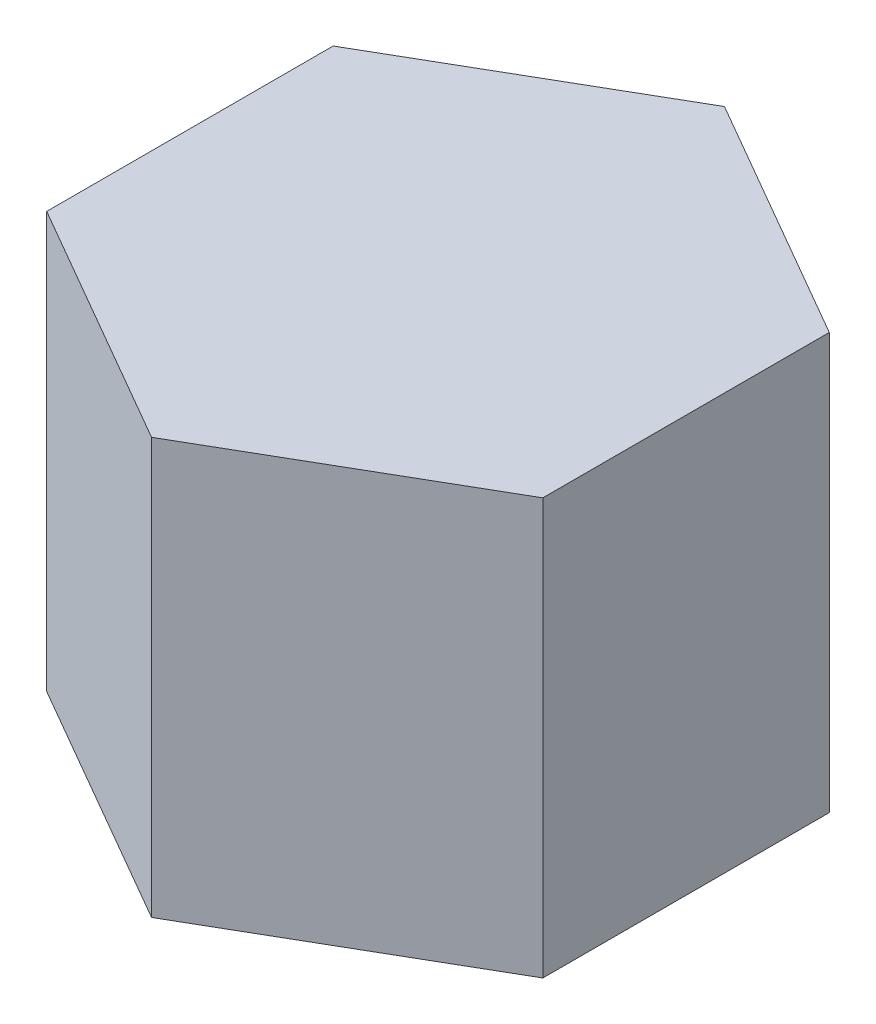
ISO-10303-21;
HEADER;
FILE_DESCRIPTION(('STEP AP214'),'2;1');
FILE_NAME('part.step','',(''),(''),'','','');
FILE_SCHEMA(('AUTOMOTIVE_DESIGN { 1 0 10303 214 1 1 1 1 }'));
ENDSEC;
DATA;
#1=APPLICATION_CONTEXT('core data for automotive mechanical design processes');
#2=APPLICATION_PROTOCOL_DEFINITION('international standard','automotive_design',2000,#1);
#3=PRODUCT_CONTEXT('',#1,'mechanical');
#4=PRODUCT('Part','Part','',(#3));
#5=PRODUCT_RELATED_PRODUCT_CATEGORY('part','',(#4));
#6=PRODUCT_DEFINITION_FORMATION('','',#4);
#7=PRODUCT_DEFINITION_CONTEXT('part definition',#1,'design');
#8=PRODUCT_DEFINITION('design','',#6,#7);
#9=PRODUCT_DEFINITION_SHAPE('','',#8);
#10=(LENGTH_UNIT() NAMED_UNIT(*) SI_UNIT(.MILLI.,.METRE.));
#11=(NAMED_UNIT(*) PLANE_ANGLE_UNIT() SI_UNIT($,.RADIAN.));
#12=(NAMED_UNIT(*) SI_UNIT($,.STERADIAN.) SOLID_ANGLE_UNIT());
#13=UNCERTAINTY_MEASURE_WITH_UNIT(LENGTH_MEASURE(1.E-05),#10,'distance_accuracy_value','');
#14=(GEOMETRIC_REPRESENTATION_CONTEXT(3) GLOBAL_UNCERTAINTY_ASSIGNED_CONTEXT((#13)) GLOBAL_UNIT_ASSIGNED_CONTEXT((#10,
#11,#12)) REPRESENTATION_CONTEXT('',''));
#15=CARTESIAN_POINT('',(0.,0.,0.));
#16=DIRECTION('',(0.,0.,1.));
#17=DIRECTION('',(1.,0.,0.));
#18=AXIS2_PLACEMENT_3D('',#15,#16,#17);
#19=CARTESIAN_POINT('',(211.142660308706,-148.537700895744,294.105047431848));
#20=DIRECTION('',(-0.499999999999909,0.,-0.866025403784491));
#21=DIRECTION('',(-0.866025403784491,0.,0.499999999999909));
#22=AXIS2_PLACEMENT_3D('',#19,#20,#21);
#23=PLANE('',#22);
#24=CARTESIAN_POINT('',(210.839551417381,-149.045793579175,294.280047431848));
#25=DIRECTION('',(0.866025403784491,0.,-0.499999999999909));
#26=VECTOR('',#25,1.);
#27=LINE('',#24,#26);
#28=CARTESIAN_POINT('',(210.839551417382,-149.045793579175,294.280047431848));
#29=VERTEX_POINT('',#28);
#30=CARTESIAN_POINT('',(211.142660308706,-149.045793579175,294.105047431848));
#31=VERTEX_POINT('',#30);
#32=EDGE_CURVE('E170',#29,#31,#27,.T.);
#33=ORIENTED_EDGE('',*,*,#32,.T.);
#34=CARTESIAN_POINT('',(211.142660308706,-148.537700895744,294.105047431848));
#35=DIRECTION('',(0.,-1.,0.));
#36=VECTOR('',#35,1.);
#37=LINE('',#34,#36);
#38=CARTESIAN_POINT('',(211.142660308706,-148.537700895744,294.105047431848));
#39=VERTEX_POINT('',#38);
#40=EDGE_CURVE('E35',#39,#31,#37,.T.);
#41=ORIENTED_EDGE('',*,*,#40,.F.);
#42=CARTESIAN_POINT('',(210.839551417381,-148.537700895744,294.280047431848));
#43=DIRECTION('',(0.866025403784491,0.,-0.499999999999909));
#44=VECTOR('',#43,1.);
#45=LINE('',#42,#44);
#46=CARTESIAN_POINT('',(210.839551417382,-148.537700895744,294.280047431848));
#47=VERTEX_POINT('',#46);
#48=EDGE_CURVE('E159',#47,#39,#45,.T.);
#49=ORIENTED_EDGE('',*,*,#48,.F.);
#50=CARTESIAN_POINT('',(210.839551417381,-148.537700895744,294.280047431848));
#51=DIRECTION('',(0.,-1.,0.));
#52=VECTOR('',#51,1.);
#53=LINE('',#50,#52);
#54=EDGE_CURVE('E10',#47,#29,#53,.T.);
#55=ORIENTED_EDGE('',*,*,#54,.T.);
#56=EDGE_LOOP('',(#33,#41,#49,#55));
#57=FACE_BOUND('',#56,.T.);
#58=ADVANCED_FACE('F16',(#57),#23,.F.);
#59=CARTESIAN_POINT('',(210.839551417382,-148.537700895744,294.280047431848));
#60=DIRECTION('',(0.500000000000096,0.,-0.866025403784383));
#61=DIRECTION('',(-0.866025403784383,0.,-0.500000000000096));
#62=AXIS2_PLACEMENT_3D('',#59,#60,#61);
#63=PLANE('',#62);
#64=CARTESIAN_POINT('',(210.536442526057,-149.045793579175,294.105047431848));
#65=DIRECTION('',(0.866025403784383,0.,0.500000000000096));
#66=VECTOR('',#65,1.);
#67=LINE('',#64,#66);
#68=CARTESIAN_POINT('',(210.536442526057,-149.045793579175,294.105047431848));
#69=VERTEX_POINT('',#68);
#70=EDGE_CURVE('E167',#69,#29,#67,.T.);
#71=ORIENTED_EDGE('',*,*,#70,.T.);
#72=ORIENTED_EDGE('',*,*,#54,.F.);
#73=CARTESIAN_POINT('',(210.536442526057,-148.537700895744,294.105047431848));
#74=DIRECTION('',(0.866025403784383,0.,0.500000000000096));
#75=VECTOR('',#74,1.);
#76=LINE('',#73,#75);
#77=CARTESIAN_POINT('',(210.536442526057,-148.537700895744,294.105047431848));
#78=VERTEX_POINT('',#77);
#79=EDGE_CURVE('E156',#78,#47,#76,.T.);
#80=ORIENTED_EDGE('',*,*,#79,.F.);
#81=CARTESIAN_POINT('',(210.536442526057,-148.537700895744,294.105047431848));
#82=DIRECTION('',(0.,-1.,0.));
#83=VECTOR('',#82,1.);
#84=LINE('',#81,#83);
#85=EDGE_CURVE('E27',#78,#69,#84,.T.);
#86=ORIENTED_EDGE('',*,*,#85,.T.);
#87=EDGE_LOOP('',(#71,#72,#80,#86));
#88=FACE_BOUND('',#87,.T.);
#89=ADVANCED_FACE('F189',(#88),#63,.F.);
#90=CARTESIAN_POINT('',(210.536442526057,-148.537700895744,290.831971220494));
#91=DIRECTION('',(1.,0.,0.));
#92=DIRECTION('',(0.,1.,0.));
#93=AXIS2_PLACEMENT_3D('',#90,#91,#92);
#94=PLANE('',#93);
#95=CARTESIAN_POINT('',(210.536442526057,-149.045793579175,293.755047431848));
#96=DIRECTION('',(0.,0.,1.));
#97=VECTOR('',#96,1.);
#98=LINE('',#95,#97);
#99=CARTESIAN_POINT('',(210.536442526057,-149.045793579175,293.755047431848));
#100=VERTEX_POINT('',#99);
#101=EDGE_CURVE('E163',#100,#69,#98,.T.);
#102=ORIENTED_EDGE('',*,*,#101,.T.);
#103=ORIENTED_EDGE('',*,*,#85,.F.);
#104=CARTESIAN_POINT('',(210.536442526057,-148.537700895744,293.755047431848));
#105=DIRECTION('',(0.,0.,1.));
#106=VECTOR('',#105,1.);
#107=LINE('',#104,#106);
#108=CARTESIAN_POINT('',(210.536442526057,-148.537700895744,293.755047431848));
#109=VERTEX_POINT('',#108);
#110=EDGE_CURVE('E106',#109,#78,#107,.T.);
#111=ORIENTED_EDGE('',*,*,#110,.F.);
#112=CARTESIAN_POINT('',(210.536442526057,-148.537700895744,293.755047431848));
#113=DIRECTION('',(0.,-1.,0.));
#114=VECTOR('',#113,1.);
#115=LINE('',#112,#114);
#116=EDGE_CURVE('E94',#109,#100,#115,.T.);
#117=ORIENTED_EDGE('',*,*,#116,.T.);
#118=EDGE_LOOP('',(#102,#103,#111,#117));
#119=FACE_BOUND('',#118,.T.);
#120=ADVANCED_FACE('F198',(#119),#94,.F.);
#121=CARTESIAN_POINT('',(210.536442526057,-148.537700895744,293.755047431848));
#122=DIRECTION('',(0.499999999999978,0.,0.866025403784452));
#123=DIRECTION('',(0.866025403784452,0.,-0.499999999999978));
#124=AXIS2_PLACEMENT_3D('',#121,#122,#123);
#125=PLANE('',#124);
#126=CARTESIAN_POINT('',(210.839551417382,-149.045793579175,293.580047431848));
#127=DIRECTION('',(-0.866025403784452,0.,0.499999999999978));
#128=VECTOR('',#127,1.);
#129=LINE('',#126,#128);
#130=CARTESIAN_POINT('',(210.839551417382,-149.045793579175,293.580047431848));
#131=VERTEX_POINT('',#130);
#132=EDGE_CURVE('E162',#131,#100,#129,.T.);
#133=ORIENTED_EDGE('',*,*,#132,.T.);
#134=ORIENTED_EDGE('',*,*,#116,.F.);
#135=CARTESIAN_POINT('',(210.839551417382,-148.537700895744,293.580047431848));
#136=DIRECTION('',(-0.866025403784452,0.,0.499999999999978));
#137=VECTOR('',#136,1.);
#138=LINE('',#135,#137);
#139=CARTESIAN_POINT('',(210.839551417382,-148.537700895744,293.580047431848));
#140=VERTEX_POINT('',#139);
#141=EDGE_CURVE('E98',#140,#109,#138,.T.);
#142=ORIENTED_EDGE('',*,*,#141,.F.);
#143=CARTESIAN_POINT('',(210.839551417382,-148.537700895744,293.580047431848));
#144=DIRECTION('',(0.,-1.,0.));
#145=VECTOR('',#144,1.);
#146=LINE('',#143,#145);
#147=EDGE_CURVE('E79',#140,#131,#146,.T.);
#148=ORIENTED_EDGE('',*,*,#147,.T.);
#149=EDGE_LOOP('',(#133,#134,#142,#148));
#150=FACE_BOUND('',#149,.T.);
#151=ADVANCED_FACE('F100',(#150),#125,.F.);
#152=CARTESIAN_POINT('',(210.839551417382,-148.537700895744,293.580047431848));
#153=DIRECTION('',(-0.500000000000062,0.,0.866025403784403));
#154=DIRECTION('',(0.866025403784403,0.,0.500000000000062));
#155=AXIS2_PLACEMENT_3D('',#152,#153,#154);
#156=PLANE('',#155);
#157=CARTESIAN_POINT('',(211.142660308706,-149.045793579175,293.755047431848));
#158=DIRECTION('',(-0.866025403784403,0.,-0.500000000000062));
#159=VECTOR('',#158,1.);
#160=LINE('',#157,#159);
#161=CARTESIAN_POINT('',(211.142660308706,-149.045793579175,293.755047431848));
#162=VERTEX_POINT('',#161);
#163=EDGE_CURVE('E88',#162,#131,#160,.T.);
#164=ORIENTED_EDGE('',*,*,#163,.T.);
#165=ORIENTED_EDGE('',*,*,#147,.F.);
#166=CARTESIAN_POINT('',(211.142660308706,-148.537700895744,293.755047431848));
#167=DIRECTION('',(-0.866025403784403,0.,-0.500000000000062));
#168=VECTOR('',#167,1.);
#169=LINE('',#166,#168);
#170=CARTESIAN_POINT('',(211.142660308706,-148.537700895744,293.755047431848));
#171=VERTEX_POINT('',#170);
#172=EDGE_CURVE('E84',#171,#140,#169,.T.);
#173=ORIENTED_EDGE('',*,*,#172,.F.);
#174=CARTESIAN_POINT('',(211.142660308706,-148.537700895744,293.755047431848));
#175=DIRECTION('',(0.,-1.,0.));
#176=VECTOR('',#175,1.);
#177=LINE('',#174,#176);
#178=EDGE_CURVE('E58',#171,#162,#177,.T.);
#179=ORIENTED_EDGE('',*,*,#178,.T.);
#180=EDGE_LOOP('',(#164,#165,#173,#179));
#181=FACE_BOUND('',#180,.T.);
#182=ADVANCED_FACE('F82',(#181),#156,.F.);
#183=CARTESIAN_POINT('',(211.142660308706,-148.537700895744,290.831971220494));
#184=DIRECTION('',(-1.,0.,0.));
#185=DIRECTION('',(0.,-1.,0.));
#186=AXIS2_PLACEMENT_3D('',#183,#184,#185);
#187=PLANE('',#186);
#188=CARTESIAN_POINT('',(211.142660308706,-149.045793579175,294.105047431848));
#189=DIRECTION('',(0.,0.,-1.));
#190=VECTOR('',#189,1.);
#191=LINE('',#188,#190);
#192=EDGE_CURVE('E160',#31,#162,#191,.T.);
#193=ORIENTED_EDGE('',*,*,#192,.T.);
#194=ORIENTED_EDGE('',*,*,#178,.F.);
#195=CARTESIAN_POINT('',(211.142660308706,-148.537700895744,294.105047431848));
#196=DIRECTION('',(0.,0.,-1.));
#197=VECTOR('',#196,1.);
#198=LINE('',#195,#197);
#199=EDGE_CURVE('E112',#39,#171,#198,.T.);
#200=ORIENTED_EDGE('',*,*,#199,.F.);
#201=ORIENTED_EDGE('',*,*,#40,.T.);
#202=EDGE_LOOP('',(#193,#194,#200,#201));
#203=FACE_BOUND('',#202,.T.);
#204=ADVANCED_FACE('F131',(#203),#187,.F.);
#205=CARTESIAN_POINT('',(206.339551417382,-148.537700895744,290.831971220494));
#206=DIRECTION('',(0.,-1.,0.));
#207=DIRECTION('',(1.,0.,0.));
#208=AXIS2_PLACEMENT_3D('',#205,#206,#207);
#209=PLANE('',#208);
#210=ORIENTED_EDGE('',*,*,#48,.T.);
#211=ORIENTED_EDGE('',*,*,#199,.T.);
#212=ORIENTED_EDGE('',*,*,#172,.T.);
#213=ORIENTED_EDGE('',*,*,#141,.T.);
#214=ORIENTED_EDGE('',*,*,#110,.T.);
#215=ORIENTED_EDGE('',*,*,#79,.T.);
#216=EDGE_LOOP('',(#210,#211,#212,#213,#214,#215));
#217=FACE_BOUND('',#216,.T.);
#218=ADVANCED_FACE('F111',(#217),#209,.F.);
#219=CARTESIAN_POINT('',(206.339551417382,-149.045793579175,290.831971220494));
#220=DIRECTION('',(0.,-1.,0.));
#221=DIRECTION('',(1.,0.,0.));
#222=AXIS2_PLACEMENT_3D('',#219,#220,#221);
#223=PLANE('',#222);
#224=ORIENTED_EDGE('',*,*,#32,.F.);
#225=ORIENTED_EDGE('',*,*,#70,.F.);
#226=ORIENTED_EDGE('',*,*,#101,.F.);
#227=ORIENTED_EDGE('',*,*,#132,.F.);
#228=ORIENTED_EDGE('',*,*,#163,.F.);
#229=ORIENTED_EDGE('',*,*,#192,.F.);
#230=EDGE_LOOP('',(#224,#225,#226,#227,#228,#229));
#231=FACE_BOUND('',#230,.T.);
#232=ADVANCED_FACE('F130',(#231),#223,.T.);
#233=CLOSED_SHELL('',(#58,#89,#120,#151,#182,#204,#218,#232));
#234=MANIFOLD_SOLID_BREP('B1',#233);
#235=ADVANCED_BREP_SHAPE_REPRESENTATION('',(#18,#234),#14);
#236=SHAPE_DEFINITION_REPRESENTATION(#9,#235);
ENDSEC;
END-ISO-10303-21;
